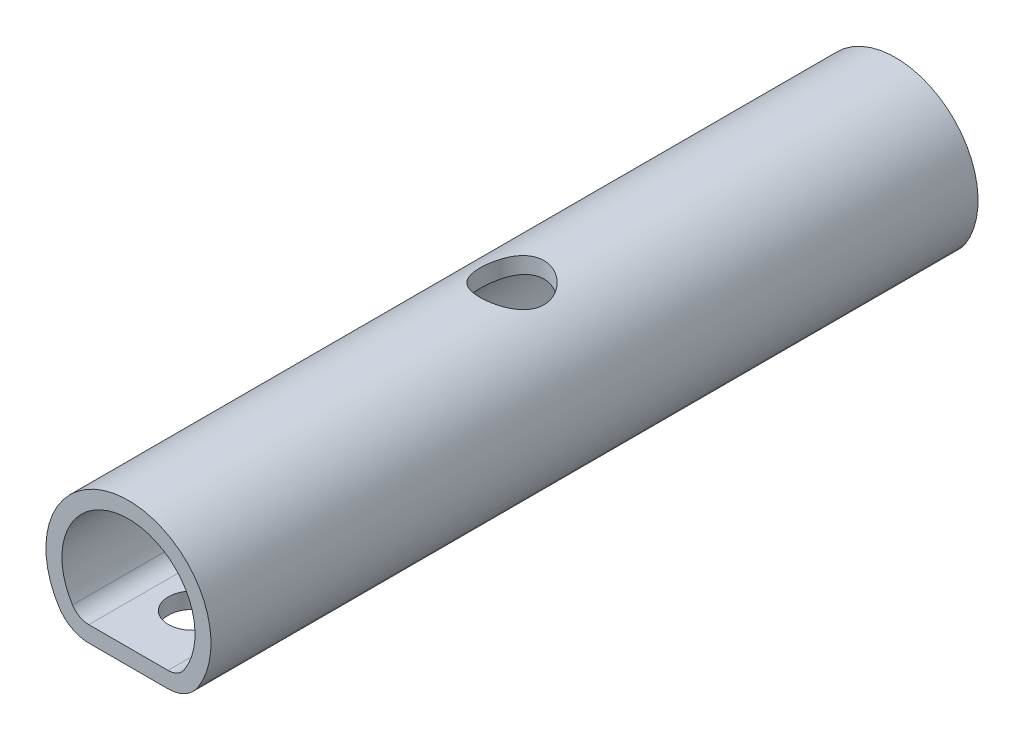
ISO-10303-21;
HEADER;
FILE_DESCRIPTION(('STEP AP214'),'2;1');
FILE_NAME('part.step','',(''),(''),'','','');
FILE_SCHEMA(('AUTOMOTIVE_DESIGN { 1 0 10303 214 1 1 1 1 }'));
ENDSEC;
DATA;
#1=APPLICATION_CONTEXT('core data for automotive mechanical design processes');
#2=APPLICATION_PROTOCOL_DEFINITION('international standard','automotive_design',2000,#1);
#3=PRODUCT_CONTEXT('',#1,'mechanical');
#4=PRODUCT('Part','Part','',(#3));
#5=PRODUCT_RELATED_PRODUCT_CATEGORY('part','',(#4));
#6=PRODUCT_DEFINITION_FORMATION('','',#4);
#7=PRODUCT_DEFINITION_CONTEXT('part definition',#1,'design');
#8=PRODUCT_DEFINITION('design','',#6,#7);
#9=PRODUCT_DEFINITION_SHAPE('','',#8);
#10=(LENGTH_UNIT() NAMED_UNIT(*) SI_UNIT(.MILLI.,.METRE.));
#11=(NAMED_UNIT(*) PLANE_ANGLE_UNIT() SI_UNIT($,.RADIAN.));
#12=(NAMED_UNIT(*) SI_UNIT($,.STERADIAN.) SOLID_ANGLE_UNIT());
#13=UNCERTAINTY_MEASURE_WITH_UNIT(LENGTH_MEASURE(1.E-05),#10,'distance_accuracy_value','');
#14=(GEOMETRIC_REPRESENTATION_CONTEXT(3) GLOBAL_UNCERTAINTY_ASSIGNED_CONTEXT((#13)) GLOBAL_UNIT_ASSIGNED_CONTEXT((#10,
#11,#12)) REPRESENTATION_CONTEXT('',''));
#15=CARTESIAN_POINT('',(0.,0.,0.));
#16=DIRECTION('',(0.,0.,1.));
#17=DIRECTION('',(1.,0.,0.));
#18=AXIS2_PLACEMENT_3D('',#15,#16,#17);
#19=CARTESIAN_POINT('',(0.,11.028742605633,38.1));
#20=DIRECTION('',(0.,0.,-1.));
#21=DIRECTION('',(-1.,0.,0.));
#22=AXIS2_PLACEMENT_3D('',#19,#20,#21);
#23=CYLINDRICAL_SURFACE('',#22,8.19905739436702);
#24=CARTESIAN_POINT('',(0.,19.2278,3.17500000000001));
#25=CARTESIAN_POINT('',(0.171424162772887,19.2277911991565,3.17498823622421));
#26=CARTESIAN_POINT('',(0.343002553758168,19.2223663783673,3.16104917029466));
#27=CARTESIAN_POINT('',(0.680901009048323,19.2012359681634,3.10585768016363));
#28=CARTESIAN_POINT('',(0.847222197506134,19.1855325924269,3.06461113711407));
#29=CARTESIAN_POINT('',(1.16982478024676,19.1455413503164,2.95652012080337));
#30=CARTESIAN_POINT('',(1.32612559235565,19.1212707189863,2.88972701806935));
#31=CARTESIAN_POINT('',(1.62527758117765,19.0665395962555,2.732703001332));
#32=CARTESIAN_POINT('',(1.76812489717223,19.0360773359297,2.64246538726552));
#33=CARTESIAN_POINT('',(2.04273125528864,18.9705638449106,2.43689692193948));
#34=CARTESIAN_POINT('',(2.17380878700702,18.9353769020247,2.32069927588018));
#35=CARTESIAN_POINT('',(2.4151732680355,18.8650245685422,2.06834887929248));
#36=CARTESIAN_POINT('',(2.52545322544648,18.8298591891412,1.93218944509252));
#37=CARTESIAN_POINT('',(2.72657207157525,18.7619241794137,1.63695343484209));
#38=CARTESIAN_POINT('',(2.81642353792352,18.7293128071671,1.47716409990969));
#39=CARTESIAN_POINT('',(2.96767160190411,18.6723052250483,1.14328308406565));
#40=CARTESIAN_POINT('',(3.02908042502925,18.6479054868071,0.96919758602184));
#41=CARTESIAN_POINT('',(3.11896856511826,18.6115422472148,0.6195307239262));
#42=CARTESIAN_POINT('',(3.14875468740271,18.5990874645754,0.444338181074272));
#43=CARTESIAN_POINT('',(3.17863641259391,18.5865929618452,0.0910326208371105));
#44=CARTESIAN_POINT('',(3.17874534631254,18.5865476674879,-0.0870790493370144));
#45=CARTESIAN_POINT('',(3.15026436786618,18.5984558875052,-0.428927399763544));
#46=CARTESIAN_POINT('',(3.1235249441628,18.6096357231379,-0.592850317939315));
#47=CARTESIAN_POINT('',(3.04517817037634,18.6414425622839,-0.913669475352172));
#48=CARTESIAN_POINT('',(2.99356681658013,18.662071086756,-1.07056457885407));
#49=CARTESIAN_POINT('',(2.86598279830513,18.7108915106369,-1.37651311012475));
#50=CARTESIAN_POINT('',(2.78955084902475,18.7392242204419,-1.5253515461523));
#51=CARTESIAN_POINT('',(2.61481638886213,18.800217694382,-1.8086122768645));
#52=CARTESIAN_POINT('',(2.51650598602068,18.8328800185649,-1.94302934349998));
#53=CARTESIAN_POINT('',(2.2924726821658,18.9017208500402,-2.20382076141625));
#54=CARTESIAN_POINT('',(2.16528514011333,18.9379831487969,-2.32891801489658));
#55=CARTESIAN_POINT('',(1.89133345680246,19.0079259672206,-2.55640137694314));
#56=CARTESIAN_POINT('',(1.74456590177925,19.041606035061,-2.65878351683322));
#57=CARTESIAN_POINT('',(1.43218741340801,19.1033405448773,-2.8394659727146));
#58=CARTESIAN_POINT('',(1.26629213071248,19.131286453217,-2.91731443472694));
#59=CARTESIAN_POINT('',(0.922405778282778,19.1775916263514,-3.04356649847487));
#60=CARTESIAN_POINT('',(0.74442049704979,19.195955442844,-3.09198408231084));
#61=CARTESIAN_POINT('',(0.392134024529115,19.2202129298388,-3.15548337865339));
#62=CARTESIAN_POINT('',(0.218186480825898,19.2267484880967,-3.17228314099771));
#63=CARTESIAN_POINT('',(-0.130146432556447,19.2286151708982,-3.17710651141569));
#64=CARTESIAN_POINT('',(-0.304531687397113,19.2239489785602,-3.16513701049556));
#65=CARTESIAN_POINT('',(-0.641191017070006,19.2043585893559,-3.11404755412279));
#66=CARTESIAN_POINT('',(-0.803667299396299,19.1898684573206,-3.0760758064376));
#67=CARTESIAN_POINT('',(-1.11981130602436,19.1525299771405,-2.97559586820301));
#68=CARTESIAN_POINT('',(-1.27347788637893,19.1296805463644,-2.91308449939623));
#69=CARTESIAN_POINT('',(-1.57282352744162,19.0770076850223,-2.76327817720011));
#70=CARTESIAN_POINT('',(-1.71812395329605,19.0469953681014,-2.67529510989513));
#71=CARTESIAN_POINT('',(-1.9923980100649,18.9832853220236,-2.4778133477823));
#72=CARTESIAN_POINT('',(-2.12136531542664,18.949586174377,-2.36830635875426));
#73=CARTESIAN_POINT('',(-2.36767517908901,18.8796061246227,-2.12292103054586));
#74=CARTESIAN_POINT('',(-2.48380388773047,18.8432945411329,-1.98582983462808));
#75=CARTESIAN_POINT('',(-2.69167579430895,18.7741578519103,-1.69342417410097));
#76=CARTESIAN_POINT('',(-2.78341597336475,18.7413331780987,-1.53810745691166));
#77=CARTESIAN_POINT('',(-2.94022057159399,18.6829394050407,-1.2118899760911));
#78=CARTESIAN_POINT('',(-3.00510288739826,18.6574201869052,-1.04089213091122));
#79=CARTESIAN_POINT('',(-3.10468843194158,18.6174438584942,-0.689122348788254));
#80=CARTESIAN_POINT('',(-3.13941204663611,18.6029792765662,-0.508357102108419));
#81=CARTESIAN_POINT('',(-3.17581054008251,18.5877850116168,-0.155433278773563));
#82=CARTESIAN_POINT('',(-3.17957300614675,18.5861878927003,0.0164742216401676));
#83=CARTESIAN_POINT('',(-3.15935546365655,18.5946618410367,0.358340208017928));
#84=CARTESIAN_POINT('',(-3.13537846818482,18.6047316410196,0.528298903637739));
#85=CARTESIAN_POINT('',(-3.06202779746754,18.6346615202139,0.855423908013566));
#86=CARTESIAN_POINT('',(-3.01356486151432,18.6541695176538,1.01282948920334));
#87=CARTESIAN_POINT('',(-2.89344329991754,18.7005514963388,1.31735389183353));
#88=CARTESIAN_POINT('',(-2.82177863642762,18.7274273946727,1.46447002349203));
#89=CARTESIAN_POINT('',(-2.65273848468415,18.7873490214264,1.75302005821734));
#90=CARTESIAN_POINT('',(-2.55416851029182,18.820652281596,1.89369986958217));
#91=CARTESIAN_POINT('',(-2.33590429930714,18.888840996625,2.15718743121144));
#92=CARTESIAN_POINT('',(-2.21620312831975,18.9237269680647,2.27998929045033));
#93=CARTESIAN_POINT('',(-1.95065161320221,18.9936306065598,2.51166228915042));
#94=CARTESIAN_POINT('',(-1.80367241728796,19.0285336969032,2.61927756832792));
#95=CARTESIAN_POINT('',(-1.49235724310303,19.0923993716805,2.80830830872397));
#96=CARTESIAN_POINT('',(-1.32801791624485,19.1213608068499,2.88971870299333));
#97=CARTESIAN_POINT('',(-1.06597974142178,19.1587385653003,2.99232370723943));
#98=CARTESIAN_POINT('',(-0.972702398309696,19.1704554049927,3.02393804675796));
#99=CARTESIAN_POINT('',(-0.783320898159099,19.1908499361536,3.07842888715785));
#100=CARTESIAN_POINT('',(-0.687218029769755,19.199528990467,3.10130930676536));
#101=CARTESIAN_POINT('',(-0.493080654860031,19.2135382547536,3.13803320819069));
#102=CARTESIAN_POINT('',(-0.395046606959842,19.2188692501734,3.15187880958496));
#103=CARTESIAN_POINT('',(-0.198025433876502,19.226002396143,3.17036490212169));
#104=CARTESIAN_POINT('',(-0.0990384562825835,19.2278050845922,3.17500679639427));
#105=CARTESIAN_POINT('',(0.,19.2278,3.17500000000001));
#106=B_SPLINE_CURVE_WITH_KNOTS('',3,(#24,#25,#26,#27,#28,#29,#30,#31,#32,#33,#34,#35,#36,#37,
#38,#39,#40,#41,#42,#43,#44,#45,#46,#47,#48,#49,#50,#51,#52,#53,#54,#55,#56,#57,#58,#59,#60,#61,
#62,#63,#64,#65,#66,#67,#68,#69,#70,#71,#72,#73,#74,#75,#76,#77,#78,#79,#80,#81,#82,#83,#84,#85,
#86,#87,#88,#89,#90,#91,#92,#93,#94,#95,#96,#97,#98,#99,#100,#101,#102,#103,#104,#105),
.UNSPECIFIED.,.T.,.F.,(4,2,2,2,2,2,2,2,2,2,2,2,2,2,2,2,2,2,2,2,2,2,2,2,2,2,2,2,2,2,2,2,2,2,2,2,
2,2,2,2,4),(0.,0.513902339321336,1.02769403660268,1.54045795743,2.05336857941378,
2.58700972995858,3.12082996578982,3.67662968579406,4.23219028435986,4.76377370576625,
5.29511834275202,5.79219373107589,6.28934916193655,6.79628512536173,7.3034042471338,
7.84705822959531,8.39080712201573,8.94405329043382,9.49703641533527,10.018991484067,
10.5408215430919,11.040979905152,11.5412030667759,12.0564535362635,12.5719029476166,
13.1192610201732,13.6666868147472,14.2177657961354,14.7684719818114,15.2817139075179,
15.7949000897058,16.2902672563489,16.785763437446,17.3084334799647,17.8312753613526,
18.3850839031295,18.9389994645117,19.2361494451153,19.5331659436205,19.8301127367136,
20.1270142559809),.UNSPECIFIED.);
#107=CARTESIAN_POINT('',(0.,19.2278,3.17500000000001));
#108=VERTEX_POINT('',#107);
#109=EDGE_CURVE('E166',#108,#108,#106,.T.);
#110=ORIENTED_EDGE('',*,*,#109,.F.);
#111=EDGE_LOOP('',(#110));
#112=FACE_BOUND('',#111,.T.);
#113=CARTESIAN_POINT('',(0.,11.028742605633,-38.1));
#114=DIRECTION('',(0.,0.,-1.));
#115=DIRECTION('',(-1.,0.,0.));
#116=AXIS2_PLACEMENT_3D('',#113,#114,#115);
#117=CIRCLE('',#116,8.19905739436702);
#118=CARTESIAN_POINT('',(-6.89566409377272,6.59316385399547,-38.1));
#119=VERTEX_POINT('',#118);
#120=CARTESIAN_POINT('',(6.89566409377272,6.59316385399547,-38.1));
#121=VERTEX_POINT('',#120);
#122=EDGE_CURVE('E138',#119,#121,#117,.T.);
#123=ORIENTED_EDGE('',*,*,#122,.F.);
#124=DIRECTION('',(0.,0.,-1.));
#125=VECTOR('',#124,1.);
#126=CARTESIAN_POINT('',(-6.89566409377272,6.59316385399547,38.1));
#127=LINE('',#126,#125);
#128=CARTESIAN_POINT('',(-6.89566409377272,6.59316385399547,38.1));
#129=VERTEX_POINT('',#128);
#130=EDGE_CURVE('E54',#119,#129,#127,.F.);
#131=ORIENTED_EDGE('',*,*,#130,.T.);
#132=CARTESIAN_POINT('',(0.,11.028742605633,38.1));
#133=DIRECTION('',(0.,0.,-1.));
#134=DIRECTION('',(-1.,0.,0.));
#135=AXIS2_PLACEMENT_3D('',#132,#133,#134);
#136=CIRCLE('',#135,8.19905739436702);
#137=CARTESIAN_POINT('',(6.89566409377272,6.59316385399547,38.1));
#138=VERTEX_POINT('',#137);
#139=EDGE_CURVE('E132',#129,#138,#136,.T.);
#140=ORIENTED_EDGE('',*,*,#139,.T.);
#141=DIRECTION('',(0.,0.,-1.));
#142=VECTOR('',#141,1.);
#143=CARTESIAN_POINT('',(6.89566409377272,6.59316385399547,38.1));
#144=LINE('',#143,#142);
#145=EDGE_CURVE('E213',#138,#121,#144,.T.);
#146=ORIENTED_EDGE('',*,*,#145,.T.);
#147=EDGE_LOOP('',(#123,#131,#140,#146));
#148=FACE_BOUND('',#147,.T.);
#149=ADVANCED_FACE('F33',(#112,#148),#23,.T.);
#150=CARTESIAN_POINT('',(5.53334406219122,4.9784,38.1));
#151=DIRECTION('',(0.,-1.,0.));
#152=DIRECTION('',(0.,0.,-1.));
#153=AXIS2_PLACEMENT_3D('',#150,#151,#152);
#154=PLANE('',#153);
#155=CARTESIAN_POINT('',(0.,4.9784,0.));
#156=DIRECTION('',(0.,1.,0.));
#157=DIRECTION('',(0.,0.,1.));
#158=AXIS2_PLACEMENT_3D('',#155,#156,#157);
#159=CIRCLE('',#158,3.17500000000001);
#160=CARTESIAN_POINT('',(0.,4.9784,3.17500000000001));
#161=VERTEX_POINT('',#160);
#162=EDGE_CURVE('E151',#161,#161,#159,.T.);
#163=ORIENTED_EDGE('',*,*,#162,.T.);
#164=EDGE_LOOP('',(#163));
#165=FACE_BOUND('',#164,.T.);
#166=CARTESIAN_POINT('',(0.,4.9784,-31.75));
#167=DIRECTION('',(0.,-1.,0.));
#168=DIRECTION('',(0.,0.,-1.));
#169=AXIS2_PLACEMENT_3D('',#166,#167,#168);
#170=CIRCLE('',#169,2.38759999999999);
#171=CARTESIAN_POINT('',(0.,4.9784,-34.1376));
#172=VERTEX_POINT('',#171);
#173=EDGE_CURVE('E173',#172,#172,#170,.T.);
#174=ORIENTED_EDGE('',*,*,#173,.F.);
#175=EDGE_LOOP('',(#174));
#176=FACE_BOUND('',#175,.T.);
#177=CARTESIAN_POINT('',(0.,4.9784,31.75));
#178=DIRECTION('',(0.,-1.,0.));
#179=DIRECTION('',(0.,0.,-1.));
#180=AXIS2_PLACEMENT_3D('',#177,#178,#179);
#181=CIRCLE('',#180,2.38759999999999);
#182=CARTESIAN_POINT('',(0.,4.9784,29.3624));
#183=VERTEX_POINT('',#182);
#184=EDGE_CURVE('E237',#183,#183,#181,.T.);
#185=ORIENTED_EDGE('',*,*,#184,.F.);
#186=EDGE_LOOP('',(#185));
#187=FACE_BOUND('',#186,.T.);
#188=DIRECTION('',(-1.,0.,0.));
#189=VECTOR('',#188,1.);
#190=CARTESIAN_POINT('',(5.53334406219122,4.9784,38.1));
#191=LINE('',#190,#189);
#192=CARTESIAN_POINT('',(3.93700000000151,4.9784,38.1));
#193=VERTEX_POINT('',#192);
#194=CARTESIAN_POINT('',(-3.93700000000151,4.9784,38.1));
#195=VERTEX_POINT('',#194);
#196=EDGE_CURVE('E134',#193,#195,#191,.T.);
#197=ORIENTED_EDGE('',*,*,#196,.T.);
#198=DIRECTION('',(0.,0.,-1.));
#199=VECTOR('',#198,1.);
#200=CARTESIAN_POINT('',(-3.93700000000151,4.9784,38.1));
#201=LINE('',#200,#199);
#202=CARTESIAN_POINT('',(-3.93700000000151,4.9784,-38.1));
#203=VERTEX_POINT('',#202);
#204=EDGE_CURVE('E198',#195,#203,#201,.T.);
#205=ORIENTED_EDGE('',*,*,#204,.T.);
#206=DIRECTION('',(-1.,0.,0.));
#207=VECTOR('',#206,1.);
#208=CARTESIAN_POINT('',(5.53334406219122,4.9784,-38.1));
#209=LINE('',#208,#207);
#210=CARTESIAN_POINT('',(3.93700000000151,4.9784,-38.1));
#211=VERTEX_POINT('',#210);
#212=EDGE_CURVE('E135',#211,#203,#209,.T.);
#213=ORIENTED_EDGE('',*,*,#212,.F.);
#214=DIRECTION('',(0.,0.,-1.));
#215=VECTOR('',#214,1.);
#216=CARTESIAN_POINT('',(3.93700000000151,4.9784,38.1));
#217=LINE('',#216,#215);
#218=EDGE_CURVE('E202',#211,#193,#217,.F.);
#219=ORIENTED_EDGE('',*,*,#218,.T.);
#220=EDGE_LOOP('',(#197,#205,#213,#219));
#221=FACE_BOUND('',#220,.T.);
#222=ADVANCED_FACE('F180',(#165,#176,#187,#221),#154,.T.);
#223=CARTESIAN_POINT('',(0.,11.028742605633,38.1));
#224=DIRECTION('',(0.,0.,-1.));
#225=DIRECTION('',(-1.,0.,0.));
#226=AXIS2_PLACEMENT_3D('',#223,#224,#225);
#227=PLANE('',#226);
#228=DIRECTION('',(1.,0.,0.));
#229=VECTOR('',#228,1.);
#230=CARTESIAN_POINT('',(-4.87808641337526,6.5659,38.1));
#231=LINE('',#230,#229);
#232=CARTESIAN_POINT('',(-3.93700000000151,6.5659,38.1));
#233=VERTEX_POINT('',#232);
#234=CARTESIAN_POINT('',(3.93700000000151,6.5659,38.1));
#235=VERTEX_POINT('',#234);
#236=EDGE_CURVE('E114',#233,#235,#231,.T.);
#237=ORIENTED_EDGE('',*,*,#236,.F.);
#238=CARTESIAN_POINT('',(-3.93700000000151,8.4963,38.1));
#239=DIRECTION('',(0.,0.,-1.));
#240=DIRECTION('',(-1.,0.,0.));
#241=AXIS2_PLACEMENT_3D('',#238,#239,#240);
#242=CIRCLE('',#241,1.9304);
#243=CARTESIAN_POINT('',(-5.56052686734167,7.45197980435853,38.1));
#244=VERTEX_POINT('',#243);
#245=EDGE_CURVE('E98',#233,#244,#242,.T.);
#246=ORIENTED_EDGE('',*,*,#245,.T.);
#247=CARTESIAN_POINT('',(0.,11.028742605633,38.1));
#248=DIRECTION('',(0.,0.,1.));
#249=DIRECTION('',(1.,0.,0.));
#250=AXIS2_PLACEMENT_3D('',#247,#248,#249);
#251=CIRCLE('',#250,6.61155739436702);
#252=CARTESIAN_POINT('',(5.56052686734167,7.45197980435853,38.1));
#253=VERTEX_POINT('',#252);
#254=EDGE_CURVE('E124',#253,#244,#251,.T.);
#255=ORIENTED_EDGE('',*,*,#254,.F.);
#256=CARTESIAN_POINT('',(3.93700000000151,8.4963,38.1));
#257=DIRECTION('',(0.,0.,-1.));
#258=DIRECTION('',(-1.,0.,0.));
#259=AXIS2_PLACEMENT_3D('',#256,#257,#258);
#260=CIRCLE('',#259,1.9304);
#261=EDGE_CURVE('E122',#253,#235,#260,.T.);
#262=ORIENTED_EDGE('',*,*,#261,.T.);
#263=EDGE_LOOP('',(#237,#246,#255,#262));
#264=FACE_BOUND('',#263,.T.);
#265=ORIENTED_EDGE('',*,*,#139,.F.);
#266=CARTESIAN_POINT('',(-3.93700000000151,8.4963,38.1));
#267=DIRECTION('',(0.,0.,-1.));
#268=DIRECTION('',(-1.,0.,0.));
#269=AXIS2_PLACEMENT_3D('',#266,#267,#268);
#270=CIRCLE('',#269,3.5179);
#271=EDGE_CURVE('E11',#129,#195,#270,.F.);
#272=ORIENTED_EDGE('',*,*,#271,.T.);
#273=ORIENTED_EDGE('',*,*,#196,.F.);
#274=CARTESIAN_POINT('',(3.93700000000151,8.4963,38.1));
#275=DIRECTION('',(0.,0.,-1.));
#276=DIRECTION('',(-1.,0.,0.));
#277=AXIS2_PLACEMENT_3D('',#274,#275,#276);
#278=CIRCLE('',#277,3.5179);
#279=EDGE_CURVE('E41',#193,#138,#278,.F.);
#280=ORIENTED_EDGE('',*,*,#279,.T.);
#281=EDGE_LOOP('',(#265,#272,#273,#280));
#282=FACE_BOUND('',#281,.T.);
#283=ADVANCED_FACE('F121',(#264,#282),#227,.F.);
#284=CARTESIAN_POINT('',(0.,11.028742605633,-38.1));
#285=DIRECTION('',(0.,0.,-1.));
#286=DIRECTION('',(-1.,0.,0.));
#287=AXIS2_PLACEMENT_3D('',#284,#285,#286);
#288=PLANE('',#287);
#289=DIRECTION('',(1.,0.,0.));
#290=VECTOR('',#289,1.);
#291=CARTESIAN_POINT('',(-4.87808641337526,6.5659,-38.1));
#292=LINE('',#291,#290);
#293=CARTESIAN_POINT('',(-3.93700000000151,6.5659,-38.1));
#294=VERTEX_POINT('',#293);
#295=CARTESIAN_POINT('',(3.93700000000151,6.5659,-38.1));
#296=VERTEX_POINT('',#295);
#297=EDGE_CURVE('E117',#294,#296,#292,.T.);
#298=ORIENTED_EDGE('',*,*,#297,.T.);
#299=CARTESIAN_POINT('',(3.93700000000151,8.4963,-38.1));
#300=DIRECTION('',(0.,0.,-1.));
#301=DIRECTION('',(-1.,0.,0.));
#302=AXIS2_PLACEMENT_3D('',#299,#300,#301);
#303=CIRCLE('',#302,1.9304);
#304=CARTESIAN_POINT('',(5.56052686734167,7.45197980435853,-38.1));
#305=VERTEX_POINT('',#304);
#306=EDGE_CURVE('E203',#296,#305,#303,.F.);
#307=ORIENTED_EDGE('',*,*,#306,.T.);
#308=CARTESIAN_POINT('',(0.,11.028742605633,-38.1));
#309=DIRECTION('',(0.,0.,1.));
#310=DIRECTION('',(1.,0.,0.));
#311=AXIS2_PLACEMENT_3D('',#308,#309,#310);
#312=CIRCLE('',#311,6.61155739436702);
#313=CARTESIAN_POINT('',(-5.56052686734167,7.45197980435853,-38.1));
#314=VERTEX_POINT('',#313);
#315=EDGE_CURVE('E123',#305,#314,#312,.T.);
#316=ORIENTED_EDGE('',*,*,#315,.T.);
#317=CARTESIAN_POINT('',(-3.93700000000151,8.4963,-38.1));
#318=DIRECTION('',(0.,0.,-1.));
#319=DIRECTION('',(-1.,0.,0.));
#320=AXIS2_PLACEMENT_3D('',#317,#318,#319);
#321=CIRCLE('',#320,1.9304);
#322=EDGE_CURVE('E108',#314,#294,#321,.F.);
#323=ORIENTED_EDGE('',*,*,#322,.T.);
#324=EDGE_LOOP('',(#298,#307,#316,#323));
#325=FACE_BOUND('',#324,.T.);
#326=ORIENTED_EDGE('',*,*,#212,.T.);
#327=CARTESIAN_POINT('',(-3.93700000000151,8.4963,-38.1));
#328=DIRECTION('',(0.,0.,-1.));
#329=DIRECTION('',(-1.,0.,0.));
#330=AXIS2_PLACEMENT_3D('',#327,#328,#329);
#331=CIRCLE('',#330,3.5179);
#332=EDGE_CURVE('E211',#203,#119,#331,.T.);
#333=ORIENTED_EDGE('',*,*,#332,.T.);
#334=ORIENTED_EDGE('',*,*,#122,.T.);
#335=CARTESIAN_POINT('',(3.93700000000151,8.4963,-38.1));
#336=DIRECTION('',(0.,0.,-1.));
#337=DIRECTION('',(-1.,0.,0.));
#338=AXIS2_PLACEMENT_3D('',#335,#336,#337);
#339=CIRCLE('',#338,3.5179);
#340=EDGE_CURVE('E205',#121,#211,#339,.T.);
#341=ORIENTED_EDGE('',*,*,#340,.T.);
#342=EDGE_LOOP('',(#326,#333,#334,#341));
#343=FACE_BOUND('',#342,.T.);
#344=ADVANCED_FACE('F218',(#325,#343),#288,.T.);
#345=CARTESIAN_POINT('',(0.,11.028742605633,-38.1));
#346=DIRECTION('',(0.,0.,1.));
#347=DIRECTION('',(1.,0.,0.));
#348=AXIS2_PLACEMENT_3D('',#345,#346,#347);
#349=CYLINDRICAL_SURFACE('',#348,6.61155739436702);
#350=CARTESIAN_POINT('',(0.,17.6403,3.17500000000001));
#351=CARTESIAN_POINT('',(0.0838889086936739,17.6402991834309,3.17499895214464));
#352=CARTESIAN_POINT('',(0.167792674626154,17.6386978248658,3.17166887413315));
#353=CARTESIAN_POINT('',(0.334966396104458,17.6323409605197,3.15839694958474));
#354=CARTESIAN_POINT('',(0.41823602394624,17.6275839228429,3.14845189185939));
#355=CARTESIAN_POINT('',(0.666401594444622,17.6087138046149,3.10878575240037));
#356=CARTESIAN_POINT('',(0.82950289449476,17.5900020150736,3.06923393883731));
#357=CARTESIAN_POINT('',(1.14535682295812,17.5422946076076,2.965865809122));
#358=CARTESIAN_POINT('',(1.29814602791232,17.5133378887322,2.90214120965546));
#359=CARTESIAN_POINT('',(1.59069627550157,17.4478427181882,2.75268771312025));
#360=CARTESIAN_POINT('',(1.73045902365909,17.4113052610738,2.66696170217542));
#361=CARTESIAN_POINT('',(2.0019270868275,17.3316094568469,2.47034117061563));
#362=CARTESIAN_POINT('',(2.132717082148,17.2881922292422,2.35828931413495));
#363=CARTESIAN_POINT('',(2.37447202645989,17.2005443710238,2.114712631651));
#364=CARTESIAN_POINT('',(2.48542311559795,17.1563131953789,1.98317430841647));
#365=CARTESIAN_POINT('',(2.6921707907252,17.0684784668101,1.69312221215692));
#366=CARTESIAN_POINT('',(2.78636069987453,17.0251360695483,1.53336408223525));
#367=CARTESIAN_POINT('',(2.90614752713055,16.9675104009213,1.28202147251538));
#368=CARTESIAN_POINT('',(2.94250236297879,16.9495281988146,1.19625783666651));
#369=CARTESIAN_POINT('',(3.00768175673283,16.9166857187681,1.021355510951));
#370=CARTESIAN_POINT('',(3.03651061048774,16.9018236607952,0.932218779872812));
#371=CARTESIAN_POINT('',(3.08485070385106,16.8765703371753,0.756409053702939));
#372=CARTESIAN_POINT('',(3.1047999351977,16.865972268772,0.669885937370265));
#373=CARTESIAN_POINT('',(3.13741144615431,16.8485092018669,0.495144995241011));
#374=CARTESIAN_POINT('',(3.15007745270489,16.8416422941708,0.40692806012418));
#375=CARTESIAN_POINT('',(3.16794324431603,16.8319256984892,0.229557979466129));
#376=CARTESIAN_POINT('',(3.17314675394563,16.8290740065028,0.140405323345626));
#377=CARTESIAN_POINT('',(3.17602792598312,16.8274950309178,-0.0380291465581014));
#378=CARTESIAN_POINT('',(3.1737062121201,16.8287674054955,-0.127310949023907));
#379=CARTESIAN_POINT('',(3.15678615694692,16.8380125145599,-0.374852819524434));
#380=CARTESIAN_POINT('',(3.13401003527685,16.8504453399417,-0.532478460620184));
#381=CARTESIAN_POINT('',(3.06562421731388,16.8867359213458,-0.841215527218417));
#382=CARTESIAN_POINT('',(3.02000813102794,16.9105968745623,-0.992325116852019));
#383=CARTESIAN_POINT('',(2.90637543327544,16.967579677175,-1.28813338130517));
#384=CARTESIAN_POINT('',(2.83786236175599,17.0009040671429,-1.43260111525021));
#385=CARTESIAN_POINT('',(2.6807471109733,17.0730579236452,-1.70864855907125));
#386=CARTESIAN_POINT('',(2.5921360153944,17.1118898306687,-1.84022251151793));
#387=CARTESIAN_POINT('',(2.38535944730088,17.1961238536219,-2.10279295058554));
#388=CARTESIAN_POINT('',(2.26496015338893,17.241766166989,-2.23195934999842));
#389=CARTESIAN_POINT('',(2.00394402392146,17.3307988223061,-2.46899343996856));
#390=CARTESIAN_POINT('',(1.8633189580454,17.3741882376712,-2.57685241744283));
#391=CARTESIAN_POINT('',(1.55870614091041,17.4559452378413,-2.77219345577419));
#392=CARTESIAN_POINT('',(1.39401182624888,17.4940445821827,-2.85869488911577));
#393=CARTESIAN_POINT('',(1.05011145727593,17.5587100079314,-3.00208675393549));
#394=CARTESIAN_POINT('',(0.870916182836418,17.5852845649741,-3.05899895227113));
#395=CARTESIAN_POINT('',(0.51816770945696,17.6221594643246,-3.13722260621621));
#396=CARTESIAN_POINT('',(0.345272727891786,17.6335718891616,-3.16097430186697));
#397=CARTESIAN_POINT('',(-0.00240130988224356,17.6425820881491,-3.1797621867884));
#398=CARTESIAN_POINT('',(-0.177179542166477,17.6401856768237,-3.17481046228086));
#399=CARTESIAN_POINT('',(-0.51063873643788,17.6225185682155,-3.13783952913527));
#400=CARTESIAN_POINT('',(-0.669588227351824,17.6081637453182,-3.10774546941261));
#401=CARTESIAN_POINT('',(-0.979897958198127,17.56915225924,-3.02427665433566));
#402=CARTESIAN_POINT('',(-1.13125732883214,17.5444944190565,-2.97089923909187));
#403=CARTESIAN_POINT('',(-1.42730468971357,17.4862149913097,-2.84083750599708));
#404=CARTESIAN_POINT('',(-1.57165639824441,17.4523467228786,-2.76350212683901));
#405=CARTESIAN_POINT('',(-1.84583454977027,17.3789993129335,-2.58843730143026));
#406=CARTESIAN_POINT('',(-1.97565461007246,17.3395177230463,-2.49069894721793));
#407=CARTESIAN_POINT('',(-2.22974055108216,17.254536194472,-2.26717590291147));
#408=CARTESIAN_POINT('',(-2.35239313354787,17.2088168892224,-2.13963700741117));
#409=CARTESIAN_POINT('',(-2.57521722862204,17.1193415255734,-1.86550420566599));
#410=CARTESIAN_POINT('',(-2.67537613393633,17.0755865790978,-1.71889968580987));
#411=CARTESIAN_POINT('',(-2.85391257420495,16.9934658412132,-1.40352109010965));
#412=CARTESIAN_POINT('',(-2.93130119751337,16.9553729429163,-1.23411010235993));
#413=CARTESIAN_POINT('',(-3.05565028795761,16.8922427354596,-0.882233943778343));
#414=CARTESIAN_POINT('',(-3.102646757534,16.8671899858777,-0.699784503956697));
#415=CARTESIAN_POINT('',(-3.16080344148698,16.8358937763994,-0.345201784177994));
#416=CARTESIAN_POINT('',(-3.17488724208858,16.8281191506013,-0.173684743757826));
#417=CARTESIAN_POINT('',(-3.17511127757764,16.8279988898818,0.169346675890975));
#418=CARTESIAN_POINT('',(-3.16126084916182,16.8356480997194,0.340861036854187));
#419=CARTESIAN_POINT('',(-3.1086860806796,16.8639394451124,0.664350894626446));
#420=CARTESIAN_POINT('',(-3.07208141197019,16.8834716133156,0.816779428074421));
#421=CARTESIAN_POINT('',(-2.97751272631487,16.9321246482216,1.11322336227448));
#422=CARTESIAN_POINT('',(-2.919542184256,16.9612484439069,1.25723617729331));
#423=CARTESIAN_POINT('',(-2.77950031876214,17.0281981186496,1.54339281470596));
#424=CARTESIAN_POINT('',(-2.69607450502211,17.0664762910872,1.68476498290529));
#425=CARTESIAN_POINT('',(-2.50906994771794,17.1465523441023,1.95240029290239));
#426=CARTESIAN_POINT('',(-2.40548128771317,17.188351950822,2.0786559505848));
#427=CARTESIAN_POINT('',(-2.16788069077657,17.2761995693261,2.32670160781538));
#428=CARTESIAN_POINT('',(-2.03178574582734,17.3222155103352,2.44651451653573));
#429=CARTESIAN_POINT('',(-1.73989703322762,17.4090684089591,2.66199886342676));
#430=CARTESIAN_POINT('',(-1.58409354919367,17.4499027920192,2.75765832368442));
#431=CARTESIAN_POINT('',(-1.33867572761279,17.5039034136922,2.88044635031459));
#432=CARTESIAN_POINT('',(-1.25489713654606,17.5206981472371,2.91793171741565));
#433=CARTESIAN_POINT('',(-1.08396396780963,17.551413200441,2.98564590540763));
#434=CARTESIAN_POINT('',(-0.996811064316819,17.5653349243885,3.01587827264729));
#435=CARTESIAN_POINT('',(-0.819982229880412,17.589861035665,3.06867283247079));
#436=CARTESIAN_POINT('',(-0.730312518031117,17.6004729292298,3.09125239079917));
#437=CARTESIAN_POINT('',(-0.549045555779973,17.6180915557101,3.12853401464564));
#438=CARTESIAN_POINT('',(-0.457449581845545,17.6251006023324,3.14324113600338));
#439=CARTESIAN_POINT('',(-0.304743013478107,17.6335520420741,3.16092971714268));
#440=CARTESIAN_POINT('',(-0.243946814644143,17.636079065654,3.16620253238106));
#441=CARTESIAN_POINT('',(-0.122103037956901,17.6394533622609,3.17323809794579));
#442=CARTESIAN_POINT('',(-0.0610554540075552,17.6403005943097,3.17500076264297));
#443=CARTESIAN_POINT('',(0.,17.6403,3.17500000000001));
#444=B_SPLINE_CURVE_WITH_KNOTS('',3,(#350,#351,#352,#353,#354,#355,#356,#357,#358,#359,#360,
#361,#362,#363,#364,#365,#366,#367,#368,#369,#370,#371,#372,#373,#374,#375,#376,#377,#378,#379,
#380,#381,#382,#383,#384,#385,#386,#387,#388,#389,#390,#391,#392,#393,#394,#395,#396,#397,#398,
#399,#400,#401,#402,#403,#404,#405,#406,#407,#408,#409,#410,#411,#412,#413,#414,#415,#416,#417,
#418,#419,#420,#421,#422,#423,#424,#425,#426,#427,#428,#429,#430,#431,#432,#433,#434,#435,#436,
#437,#438,#439,#440,#441,#442,#443),.UNSPECIFIED.,.T.,.F.,(4,2,2,2,2,2,2,2,2,2,2,2,2,2,2,2,2,2,
2,2,2,2,2,2,2,2,2,2,2,2,2,2,2,2,2,2,2,2,2,2,2,2,2,2,2,2,4),(0.,0.251602113810208,
0.503326455058478,1.00722297265448,1.50922641927506,2.01116404719869,2.54175304219964,
3.07271128111067,3.64087467349584,3.92515416146743,4.20927102544385,4.47716718097523,
4.74492612755843,5.01255138776554,5.28015446638708,5.75693777426091,6.23385454756889,
6.72186683682635,7.21009605349415,7.75484424333453,8.29981473391213,8.86645196425666,
9.43267176488712,9.95452208915867,10.476152692559,10.9611533808298,11.4462094900742,
11.9458147228153,12.4456385416886,12.9915058243174,13.53767829622,14.1049129995751,
14.6714745217956,15.1854025430256,15.6991588181565,16.1710354443761,16.6430563007447,
17.1467016214834,17.6505952725587,18.2092602068151,18.7682016463155,19.0478005994341,
19.3272625629557,19.606086058093,19.8847302715959,20.0678451409737,20.2509644773336),.UNSPECIFIED.);
#445=CARTESIAN_POINT('',(0.,17.6403,3.17500000000001));
#446=VERTEX_POINT('',#445);
#447=EDGE_CURVE('E143',#446,#446,#444,.T.);
#448=ORIENTED_EDGE('',*,*,#447,.T.);
#449=EDGE_LOOP('',(#448));
#450=FACE_BOUND('',#449,.T.);
#451=ORIENTED_EDGE('',*,*,#254,.T.);
#452=DIRECTION('',(0.,0.,1.));
#453=VECTOR('',#452,1.);
#454=CARTESIAN_POINT('',(-5.56052686734167,7.45197980435853,-38.1));
#455=LINE('',#454,#453);
#456=EDGE_CURVE('E103',#244,#314,#455,.F.);
#457=ORIENTED_EDGE('',*,*,#456,.T.);
#458=ORIENTED_EDGE('',*,*,#315,.F.);
#459=DIRECTION('',(0.,0.,1.));
#460=VECTOR('',#459,1.);
#461=CARTESIAN_POINT('',(5.56052686734167,7.45197980435853,-38.1));
#462=LINE('',#461,#460);
#463=EDGE_CURVE('E118',#305,#253,#462,.T.);
#464=ORIENTED_EDGE('',*,*,#463,.T.);
#465=EDGE_LOOP('',(#451,#457,#458,#464));
#466=FACE_BOUND('',#465,.T.);
#467=ADVANCED_FACE('F152',(#450,#466),#349,.F.);
#468=CARTESIAN_POINT('',(-4.87808641337526,6.5659,-38.1));
#469=DIRECTION('',(0.,-1.,0.));
#470=DIRECTION('',(0.,0.,-1.));
#471=AXIS2_PLACEMENT_3D('',#468,#469,#470);
#472=PLANE('',#471);
#473=CARTESIAN_POINT('',(0.,6.5659,0.));
#474=DIRECTION('',(0.,-1.,0.));
#475=DIRECTION('',(0.,0.,-1.));
#476=AXIS2_PLACEMENT_3D('',#473,#474,#475);
#477=CIRCLE('',#476,3.17500000000001);
#478=CARTESIAN_POINT('',(0.,6.5659,-3.17500000000001));
#479=VERTEX_POINT('',#478);
#480=EDGE_CURVE('E150',#479,#479,#477,.T.);
#481=ORIENTED_EDGE('',*,*,#480,.T.);
#482=EDGE_LOOP('',(#481));
#483=FACE_BOUND('',#482,.T.);
#484=CARTESIAN_POINT('',(0.,6.5659,-31.75));
#485=DIRECTION('',(0.,-1.,0.));
#486=DIRECTION('',(0.,0.,-1.));
#487=AXIS2_PLACEMENT_3D('',#484,#485,#486);
#488=CIRCLE('',#487,2.38759999999999);
#489=CARTESIAN_POINT('',(0.,6.5659,-34.1376));
#490=VERTEX_POINT('',#489);
#491=EDGE_CURVE('E239',#490,#490,#488,.T.);
#492=ORIENTED_EDGE('',*,*,#491,.T.);
#493=EDGE_LOOP('',(#492));
#494=FACE_BOUND('',#493,.T.);
#495=CARTESIAN_POINT('',(0.,6.5659,31.75));
#496=DIRECTION('',(0.,-1.,0.));
#497=DIRECTION('',(0.,0.,-1.));
#498=AXIS2_PLACEMENT_3D('',#495,#496,#497);
#499=CIRCLE('',#498,2.38759999999999);
#500=CARTESIAN_POINT('',(0.,6.5659,29.3624));
#501=VERTEX_POINT('',#500);
#502=EDGE_CURVE('E128',#501,#501,#499,.T.);
#503=ORIENTED_EDGE('',*,*,#502,.T.);
#504=EDGE_LOOP('',(#503));
#505=FACE_BOUND('',#504,.T.);
#506=ORIENTED_EDGE('',*,*,#297,.F.);
#507=DIRECTION('',(0.,0.,-1.));
#508=VECTOR('',#507,1.);
#509=CARTESIAN_POINT('',(-3.93700000000151,6.5659,38.1));
#510=LINE('',#509,#508);
#511=EDGE_CURVE('E102',#294,#233,#510,.F.);
#512=ORIENTED_EDGE('',*,*,#511,.T.);
#513=ORIENTED_EDGE('',*,*,#236,.T.);
#514=DIRECTION('',(0.,0.,-1.));
#515=VECTOR('',#514,1.);
#516=CARTESIAN_POINT('',(3.93700000000151,6.5659,-38.1));
#517=LINE('',#516,#515);
#518=EDGE_CURVE('E119',#235,#296,#517,.T.);
#519=ORIENTED_EDGE('',*,*,#518,.T.);
#520=EDGE_LOOP('',(#506,#512,#513,#519));
#521=FACE_BOUND('',#520,.T.);
#522=ADVANCED_FACE('F113',(#483,#494,#505,#521),#472,.F.);
#523=CARTESIAN_POINT('',(0.,4.9784,31.75));
#524=DIRECTION('',(0.,-1.,0.));
#525=DIRECTION('',(0.,0.,-1.));
#526=AXIS2_PLACEMENT_3D('',#523,#524,#525);
#527=CYLINDRICAL_SURFACE('',#526,2.38759999999999);
#528=ORIENTED_EDGE('',*,*,#502,.F.);
#529=EDGE_LOOP('',(#528));
#530=FACE_BOUND('',#529,.T.);
#531=ORIENTED_EDGE('',*,*,#184,.T.);
#532=EDGE_LOOP('',(#531));
#533=FACE_BOUND('',#532,.T.);
#534=ADVANCED_FACE('F252',(#530,#533),#527,.F.);
#535=CARTESIAN_POINT('',(0.,4.9784,-31.75));
#536=DIRECTION('',(0.,-1.,0.));
#537=DIRECTION('',(0.,0.,-1.));
#538=AXIS2_PLACEMENT_3D('',#535,#536,#537);
#539=CYLINDRICAL_SURFACE('',#538,2.38759999999999);
#540=ORIENTED_EDGE('',*,*,#491,.F.);
#541=EDGE_LOOP('',(#540));
#542=FACE_BOUND('',#541,.T.);
#543=ORIENTED_EDGE('',*,*,#173,.T.);
#544=EDGE_LOOP('',(#543));
#545=FACE_BOUND('',#544,.T.);
#546=ADVANCED_FACE('F162',(#542,#545),#539,.F.);
#547=CARTESIAN_POINT('',(0.,19.2278,0.));
#548=DIRECTION('',(0.,1.,0.));
#549=DIRECTION('',(0.,0.,1.));
#550=AXIS2_PLACEMENT_3D('',#547,#548,#549);
#551=CYLINDRICAL_SURFACE('',#550,3.17500000000001);
#552=ORIENTED_EDGE('',*,*,#109,.T.);
#553=EDGE_LOOP('',(#552));
#554=FACE_BOUND('',#553,.T.);
#555=ORIENTED_EDGE('',*,*,#447,.F.);
#556=EDGE_LOOP('',(#555));
#557=FACE_BOUND('',#556,.T.);
#558=ADVANCED_FACE('F160',(#554,#557),#551,.F.);
#559=ORIENTED_EDGE('',*,*,#162,.F.);
#560=EDGE_LOOP('',(#559));
#561=FACE_BOUND('',#560,.T.);
#562=ORIENTED_EDGE('',*,*,#480,.F.);
#563=EDGE_LOOP('',(#562));
#564=FACE_BOUND('',#563,.T.);
#565=ADVANCED_FACE('F156',(#561,#564),#551,.F.);
#566=CARTESIAN_POINT('',(-3.93700000000151,8.4963,-38.1));
#567=DIRECTION('',(0.,0.,1.));
#568=DIRECTION('',(1.,0.,0.));
#569=AXIS2_PLACEMENT_3D('',#566,#567,#568);
#570=CYLINDRICAL_SURFACE('',#569,1.9304);
#571=ORIENTED_EDGE('',*,*,#322,.F.);
#572=ORIENTED_EDGE('',*,*,#456,.F.);
#573=ORIENTED_EDGE('',*,*,#245,.F.);
#574=ORIENTED_EDGE('',*,*,#511,.F.);
#575=EDGE_LOOP('',(#571,#572,#573,#574));
#576=FACE_BOUND('',#575,.T.);
#577=ADVANCED_FACE('F101',(#576),#570,.F.);
#578=CARTESIAN_POINT('',(3.93700000000151,8.4963,-38.1));
#579=DIRECTION('',(0.,0.,1.));
#580=DIRECTION('',(1.,0.,0.));
#581=AXIS2_PLACEMENT_3D('',#578,#579,#580);
#582=CYLINDRICAL_SURFACE('',#581,1.9304);
#583=ORIENTED_EDGE('',*,*,#306,.F.);
#584=ORIENTED_EDGE('',*,*,#518,.F.);
#585=ORIENTED_EDGE('',*,*,#261,.F.);
#586=ORIENTED_EDGE('',*,*,#463,.F.);
#587=EDGE_LOOP('',(#583,#584,#585,#586));
#588=FACE_BOUND('',#587,.T.);
#589=ADVANCED_FACE('F185',(#588),#582,.F.);
#590=CARTESIAN_POINT('',(-3.93700000000151,8.4963,38.1));
#591=DIRECTION('',(0.,0.,-1.));
#592=DIRECTION('',(-1.,0.,0.));
#593=AXIS2_PLACEMENT_3D('',#590,#591,#592);
#594=CYLINDRICAL_SURFACE('',#593,3.5179);
#595=ORIENTED_EDGE('',*,*,#271,.F.);
#596=ORIENTED_EDGE('',*,*,#130,.F.);
#597=ORIENTED_EDGE('',*,*,#332,.F.);
#598=ORIENTED_EDGE('',*,*,#204,.F.);
#599=EDGE_LOOP('',(#595,#596,#597,#598));
#600=FACE_BOUND('',#599,.T.);
#601=ADVANCED_FACE('F187',(#600),#594,.T.);
#602=CARTESIAN_POINT('',(3.93700000000151,8.4963,38.1));
#603=DIRECTION('',(0.,0.,-1.));
#604=DIRECTION('',(-1.,0.,0.));
#605=AXIS2_PLACEMENT_3D('',#602,#603,#604);
#606=CYLINDRICAL_SURFACE('',#605,3.5179);
#607=ORIENTED_EDGE('',*,*,#279,.F.);
#608=ORIENTED_EDGE('',*,*,#218,.F.);
#609=ORIENTED_EDGE('',*,*,#340,.F.);
#610=ORIENTED_EDGE('',*,*,#145,.F.);
#611=EDGE_LOOP('',(#607,#608,#609,#610));
#612=FACE_BOUND('',#611,.T.);
#613=ADVANCED_FACE('F35',(#612),#606,.T.);
#614=CLOSED_SHELL('',(#149,#222,#283,#344,#467,#522,#534,#546,#558,#565,#577,#589,#601,#613));
#615=MANIFOLD_SOLID_BREP('B2',#614);
#616=ADVANCED_BREP_SHAPE_REPRESENTATION('',(#18,#615),#14);
#617=SHAPE_DEFINITION_REPRESENTATION(#9,#616);
ENDSEC;
END-ISO-10303-21;
